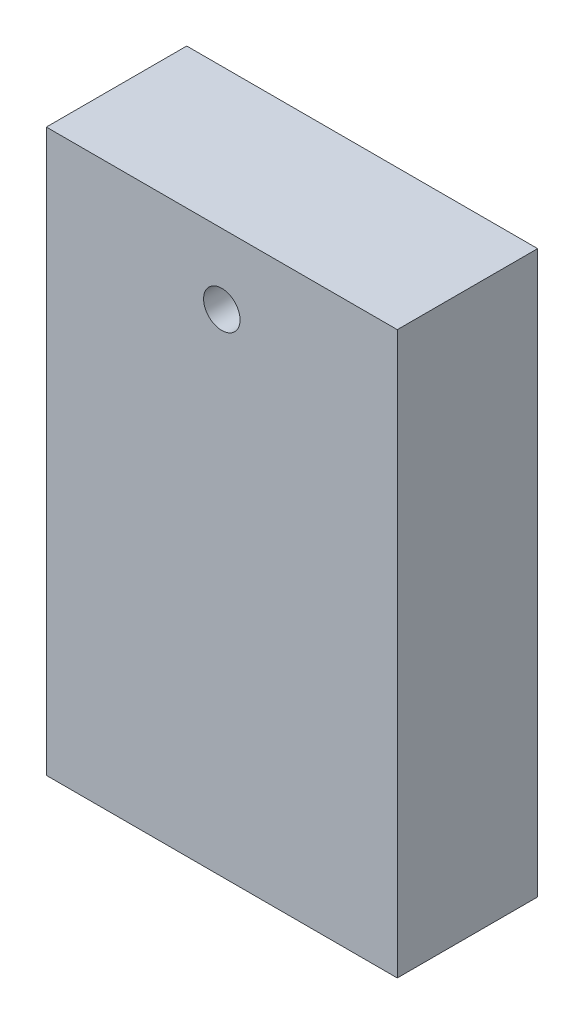
ISO-10303-21;
HEADER;
FILE_DESCRIPTION(('STEP AP214'),'2;1');
FILE_NAME('part.step','',(''),(''),'','','');
FILE_SCHEMA(('AUTOMOTIVE_DESIGN { 1 0 10303 214 1 1 1 1 }'));
ENDSEC;
DATA;
#1=APPLICATION_CONTEXT('core data for automotive mechanical design processes');
#2=APPLICATION_PROTOCOL_DEFINITION('international standard','automotive_design',2000,#1);
#3=PRODUCT_CONTEXT('',#1,'mechanical');
#4=PRODUCT('Part','Part','',(#3));
#5=PRODUCT_RELATED_PRODUCT_CATEGORY('part','',(#4));
#6=PRODUCT_DEFINITION_FORMATION('','',#4);
#7=PRODUCT_DEFINITION_CONTEXT('part definition',#1,'design');
#8=PRODUCT_DEFINITION('design','',#6,#7);
#9=PRODUCT_DEFINITION_SHAPE('','',#8);
#10=(LENGTH_UNIT() NAMED_UNIT(*) SI_UNIT(.MILLI.,.METRE.));
#11=(NAMED_UNIT(*) PLANE_ANGLE_UNIT() SI_UNIT($,.RADIAN.));
#12=(NAMED_UNIT(*) SI_UNIT($,.STERADIAN.) SOLID_ANGLE_UNIT());
#13=UNCERTAINTY_MEASURE_WITH_UNIT(LENGTH_MEASURE(1.E-05),#10,'distance_accuracy_value','');
#14=(GEOMETRIC_REPRESENTATION_CONTEXT(3) GLOBAL_UNCERTAINTY_ASSIGNED_CONTEXT((#13)) GLOBAL_UNIT_ASSIGNED_CONTEXT((#10,
#11,#12)) REPRESENTATION_CONTEXT('',''));
#15=CARTESIAN_POINT('',(0.,0.,0.));
#16=DIRECTION('',(0.,0.,1.));
#17=DIRECTION('',(1.,0.,0.));
#18=AXIS2_PLACEMENT_3D('',#15,#16,#17);
#19=CARTESIAN_POINT('',(0.,0.,10.));
#20=DIRECTION('',(0.,0.,1.));
#21=DIRECTION('',(1.,0.,0.));
#22=AXIS2_PLACEMENT_3D('',#19,#20,#21);
#23=PLANE('',#22);
#24=DIRECTION('',(0.,1.,0.));
#25=VECTOR('',#24,1.);
#26=CARTESIAN_POINT('',(12.5,20.,10.));
#27=LINE('',#26,#25);
#28=CARTESIAN_POINT('',(12.5,-20.,10.));
#29=VERTEX_POINT('',#28);
#30=CARTESIAN_POINT('',(12.5,20.,10.));
#31=VERTEX_POINT('',#30);
#32=EDGE_CURVE('E85',#29,#31,#27,.T.);
#33=ORIENTED_EDGE('',*,*,#32,.T.);
#34=DIRECTION('',(-1.,0.,0.));
#35=VECTOR('',#34,1.);
#36=CARTESIAN_POINT('',(-12.5,20.,10.));
#37=LINE('',#36,#35);
#38=CARTESIAN_POINT('',(-12.5,20.,10.));
#39=VERTEX_POINT('',#38);
#40=EDGE_CURVE('E80',#31,#39,#37,.T.);
#41=ORIENTED_EDGE('',*,*,#40,.T.);
#42=DIRECTION('',(0.,-1.,0.));
#43=VECTOR('',#42,1.);
#44=CARTESIAN_POINT('',(-12.5,20.,10.));
#45=LINE('',#44,#43);
#46=CARTESIAN_POINT('',(-12.5,-20.,10.));
#47=VERTEX_POINT('',#46);
#48=EDGE_CURVE('E83',#39,#47,#45,.T.);
#49=ORIENTED_EDGE('',*,*,#48,.T.);
#50=DIRECTION('',(1.,0.,0.));
#51=VECTOR('',#50,1.);
#52=CARTESIAN_POINT('',(-12.5,-20.,10.));
#53=LINE('',#52,#51);
#54=EDGE_CURVE('E50',#47,#29,#53,.T.);
#55=ORIENTED_EDGE('',*,*,#54,.T.);
#56=EDGE_LOOP('',(#33,#41,#49,#55));
#57=FACE_BOUND('',#56,.T.);
#58=CARTESIAN_POINT('',(0.,15.,10.));
#59=DIRECTION('',(0.,0.,1.));
#60=DIRECTION('',(1.,0.,0.));
#61=AXIS2_PLACEMENT_3D('',#58,#59,#60);
#62=CIRCLE('',#61,1.3);
#63=CARTESIAN_POINT('',(1.3,15.,10.));
#64=VERTEX_POINT('',#63);
#65=EDGE_CURVE('E100',#64,#64,#62,.T.);
#66=ORIENTED_EDGE('',*,*,#65,.F.);
#67=EDGE_LOOP('',(#66));
#68=FACE_BOUND('',#67,.T.);
#69=ADVANCED_FACE('F33',(#57,#68),#23,.T.);
#70=CARTESIAN_POINT('',(0.,0.,0.));
#71=DIRECTION('',(0.,0.,1.));
#72=DIRECTION('',(1.,0.,0.));
#73=AXIS2_PLACEMENT_3D('',#70,#71,#72);
#74=PLANE('',#73);
#75=DIRECTION('',(0.,1.,0.));
#76=VECTOR('',#75,1.);
#77=CARTESIAN_POINT('',(12.5,20.,0.));
#78=LINE('',#77,#76);
#79=CARTESIAN_POINT('',(12.5,-20.,0.));
#80=VERTEX_POINT('',#79);
#81=CARTESIAN_POINT('',(12.5,20.,0.));
#82=VERTEX_POINT('',#81);
#83=EDGE_CURVE('E97',#80,#82,#78,.T.);
#84=ORIENTED_EDGE('',*,*,#83,.F.);
#85=DIRECTION('',(1.,0.,0.));
#86=VECTOR('',#85,1.);
#87=CARTESIAN_POINT('',(-12.5,-20.,0.));
#88=LINE('',#87,#86);
#89=CARTESIAN_POINT('',(-12.5,-20.,0.));
#90=VERTEX_POINT('',#89);
#91=EDGE_CURVE('E73',#90,#80,#88,.T.);
#92=ORIENTED_EDGE('',*,*,#91,.F.);
#93=DIRECTION('',(0.,-1.,0.));
#94=VECTOR('',#93,1.);
#95=CARTESIAN_POINT('',(-12.5,20.,0.));
#96=LINE('',#95,#94);
#97=CARTESIAN_POINT('',(-12.5,20.,0.));
#98=VERTEX_POINT('',#97);
#99=EDGE_CURVE('E67',#98,#90,#96,.T.);
#100=ORIENTED_EDGE('',*,*,#99,.F.);
#101=DIRECTION('',(-1.,0.,0.));
#102=VECTOR('',#101,1.);
#103=CARTESIAN_POINT('',(-12.5,20.,0.));
#104=LINE('',#103,#102);
#105=EDGE_CURVE('E89',#82,#98,#104,.T.);
#106=ORIENTED_EDGE('',*,*,#105,.F.);
#107=EDGE_LOOP('',(#84,#92,#100,#106));
#108=FACE_BOUND('',#107,.T.);
#109=CARTESIAN_POINT('',(0.,15.,0.));
#110=DIRECTION('',(0.,0.,1.));
#111=DIRECTION('',(1.,0.,0.));
#112=AXIS2_PLACEMENT_3D('',#109,#110,#111);
#113=CIRCLE('',#112,1.3);
#114=CARTESIAN_POINT('',(1.3,15.,0.));
#115=VERTEX_POINT('',#114);
#116=EDGE_CURVE('E112',#115,#115,#113,.T.);
#117=ORIENTED_EDGE('',*,*,#116,.T.);
#118=EDGE_LOOP('',(#117));
#119=FACE_BOUND('',#118,.T.);
#120=ADVANCED_FACE('F108',(#108,#119),#74,.F.);
#121=CARTESIAN_POINT('',(12.5,20.,10.));
#122=DIRECTION('',(-1.,0.,0.));
#123=DIRECTION('',(0.,-1.,0.));
#124=AXIS2_PLACEMENT_3D('',#121,#122,#123);
#125=PLANE('',#124);
#126=ORIENTED_EDGE('',*,*,#83,.T.);
#127=DIRECTION('',(0.,0.,-1.));
#128=VECTOR('',#127,1.);
#129=CARTESIAN_POINT('',(12.5,20.,10.));
#130=LINE('',#129,#128);
#131=EDGE_CURVE('E11',#31,#82,#130,.T.);
#132=ORIENTED_EDGE('',*,*,#131,.F.);
#133=ORIENTED_EDGE('',*,*,#32,.F.);
#134=DIRECTION('',(0.,0.,-1.));
#135=VECTOR('',#134,1.);
#136=CARTESIAN_POINT('',(12.5,-20.,10.));
#137=LINE('',#136,#135);
#138=EDGE_CURVE('E93',#29,#80,#137,.T.);
#139=ORIENTED_EDGE('',*,*,#138,.T.);
#140=EDGE_LOOP('',(#126,#132,#133,#139));
#141=FACE_BOUND('',#140,.T.);
#142=ADVANCED_FACE('F35',(#141),#125,.F.);
#143=CARTESIAN_POINT('',(-12.5,20.,10.));
#144=DIRECTION('',(0.,-1.,0.));
#145=DIRECTION('',(0.,0.,-1.));
#146=AXIS2_PLACEMENT_3D('',#143,#144,#145);
#147=PLANE('',#146);
#148=ORIENTED_EDGE('',*,*,#105,.T.);
#149=DIRECTION('',(0.,0.,-1.));
#150=VECTOR('',#149,1.);
#151=CARTESIAN_POINT('',(-12.5,20.,10.));
#152=LINE('',#151,#150);
#153=EDGE_CURVE('E42',#39,#98,#152,.T.);
#154=ORIENTED_EDGE('',*,*,#153,.F.);
#155=ORIENTED_EDGE('',*,*,#40,.F.);
#156=ORIENTED_EDGE('',*,*,#131,.T.);
#157=EDGE_LOOP('',(#148,#154,#155,#156));
#158=FACE_BOUND('',#157,.T.);
#159=ADVANCED_FACE('F88',(#158),#147,.F.);
#160=CARTESIAN_POINT('',(-12.5,20.,10.));
#161=DIRECTION('',(1.,0.,0.));
#162=DIRECTION('',(0.,1.,0.));
#163=AXIS2_PLACEMENT_3D('',#160,#161,#162);
#164=PLANE('',#163);
#165=ORIENTED_EDGE('',*,*,#99,.T.);
#166=DIRECTION('',(0.,0.,-1.));
#167=VECTOR('',#166,1.);
#168=CARTESIAN_POINT('',(-12.5,-20.,10.));
#169=LINE('',#168,#167);
#170=EDGE_CURVE('E90',#47,#90,#169,.T.);
#171=ORIENTED_EDGE('',*,*,#170,.F.);
#172=ORIENTED_EDGE('',*,*,#48,.F.);
#173=ORIENTED_EDGE('',*,*,#153,.T.);
#174=EDGE_LOOP('',(#165,#171,#172,#173));
#175=FACE_BOUND('',#174,.T.);
#176=ADVANCED_FACE('F91',(#175),#164,.F.);
#177=CARTESIAN_POINT('',(-12.5,-20.,10.));
#178=DIRECTION('',(0.,1.,0.));
#179=DIRECTION('',(-1.,0.,0.));
#180=AXIS2_PLACEMENT_3D('',#177,#178,#179);
#181=PLANE('',#180);
#182=ORIENTED_EDGE('',*,*,#91,.T.);
#183=ORIENTED_EDGE('',*,*,#138,.F.);
#184=ORIENTED_EDGE('',*,*,#54,.F.);
#185=ORIENTED_EDGE('',*,*,#170,.T.);
#186=EDGE_LOOP('',(#182,#183,#184,#185));
#187=FACE_BOUND('',#186,.T.);
#188=ADVANCED_FACE('F105',(#187),#181,.F.);
#189=CARTESIAN_POINT('',(0.,15.,10.));
#190=DIRECTION('',(0.,0.,-1.));
#191=DIRECTION('',(-1.,0.,0.));
#192=AXIS2_PLACEMENT_3D('',#189,#190,#191);
#193=CYLINDRICAL_SURFACE('',#192,1.3);
#194=ORIENTED_EDGE('',*,*,#65,.T.);
#195=EDGE_LOOP('',(#194));
#196=FACE_BOUND('',#195,.T.);
#197=ORIENTED_EDGE('',*,*,#116,.F.);
#198=EDGE_LOOP('',(#197));
#199=FACE_BOUND('',#198,.T.);
#200=ADVANCED_FACE('F118',(#196,#199),#193,.F.);
#201=CLOSED_SHELL('',(#69,#120,#142,#159,#176,#188,#200));
#202=MANIFOLD_SOLID_BREP('B2',#201);
#203=ADVANCED_BREP_SHAPE_REPRESENTATION('',(#18,#202),#14);
#204=SHAPE_DEFINITION_REPRESENTATION(#9,#203);
ENDSEC;
END-ISO-10303-21;
